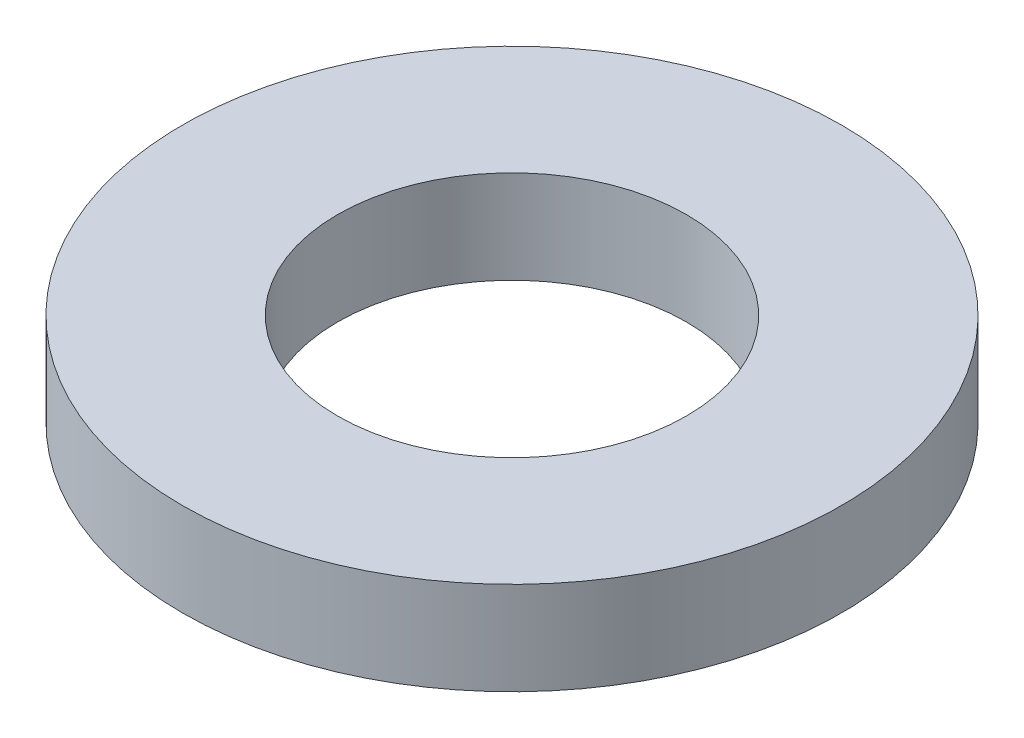
ISO-10303-21;
HEADER;
FILE_DESCRIPTION(('STEP AP214'),'2;1');
FILE_NAME('part.step','',(''),(''),'','','');
FILE_SCHEMA(('AUTOMOTIVE_DESIGN { 1 0 10303 214 1 1 1 1 }'));
ENDSEC;
DATA;
#1=APPLICATION_CONTEXT('core data for automotive mechanical design processes');
#2=APPLICATION_PROTOCOL_DEFINITION('international standard','automotive_design',2000,#1);
#3=PRODUCT_CONTEXT('',#1,'mechanical');
#4=PRODUCT('Part','Part','',(#3));
#5=PRODUCT_RELATED_PRODUCT_CATEGORY('part','',(#4));
#6=PRODUCT_DEFINITION_FORMATION('','',#4);
#7=PRODUCT_DEFINITION_CONTEXT('part definition',#1,'design');
#8=PRODUCT_DEFINITION('design','',#6,#7);
#9=PRODUCT_DEFINITION_SHAPE('','',#8);
#10=(LENGTH_UNIT() NAMED_UNIT(*) SI_UNIT(.MILLI.,.METRE.));
#11=(NAMED_UNIT(*) PLANE_ANGLE_UNIT() SI_UNIT($,.RADIAN.));
#12=(NAMED_UNIT(*) SI_UNIT($,.STERADIAN.) SOLID_ANGLE_UNIT());
#13=UNCERTAINTY_MEASURE_WITH_UNIT(LENGTH_MEASURE(1.E-05),#10,'distance_accuracy_value','');
#14=(GEOMETRIC_REPRESENTATION_CONTEXT(3) GLOBAL_UNCERTAINTY_ASSIGNED_CONTEXT((#13)) GLOBAL_UNIT_ASSIGNED_CONTEXT((#10,
#11,#12)) REPRESENTATION_CONTEXT('',''));
#15=CARTESIAN_POINT('',(0.,0.,0.));
#16=DIRECTION('',(0.,0.,1.));
#17=DIRECTION('',(1.,0.,0.));
#18=AXIS2_PLACEMENT_3D('',#15,#16,#17);
#19=CARTESIAN_POINT('',(0.,24.,0.));
#20=DIRECTION('',(0.,-1.,0.));
#21=DIRECTION('',(0.,0.,-1.));
#22=AXIS2_PLACEMENT_3D('',#19,#20,#21);
#23=CYLINDRICAL_SURFACE('',#22,85.);
#24=CARTESIAN_POINT('',(0.,24.,0.));
#25=DIRECTION('',(0.,1.,0.));
#26=DIRECTION('',(0.,0.,1.));
#27=AXIS2_PLACEMENT_3D('',#24,#25,#26);
#28=CIRCLE('',#27,85.);
#29=CARTESIAN_POINT('',(0.,24.,85.));
#30=VERTEX_POINT('',#29);
#31=EDGE_CURVE('E10',#30,#30,#28,.T.);
#32=ORIENTED_EDGE('',*,*,#31,.F.);
#33=EDGE_LOOP('',(#32));
#34=FACE_BOUND('',#33,.T.);
#35=CARTESIAN_POINT('',(0.,0.,0.));
#36=DIRECTION('',(0.,1.,0.));
#37=DIRECTION('',(0.,0.,1.));
#38=AXIS2_PLACEMENT_3D('',#35,#36,#37);
#39=CIRCLE('',#38,85.);
#40=CARTESIAN_POINT('',(0.,0.,85.));
#41=VERTEX_POINT('',#40);
#42=EDGE_CURVE('E37',#41,#41,#39,.T.);
#43=ORIENTED_EDGE('',*,*,#42,.T.);
#44=EDGE_LOOP('',(#43));
#45=FACE_BOUND('',#44,.T.);
#46=ADVANCED_FACE('F40',(#34,#45),#23,.T.);
#47=CARTESIAN_POINT('',(0.,24.,0.));
#48=DIRECTION('',(0.,1.,0.));
#49=DIRECTION('',(0.,0.,1.));
#50=AXIS2_PLACEMENT_3D('',#47,#48,#49);
#51=PLANE('',#50);
#52=CARTESIAN_POINT('',(0.,24.,0.));
#53=DIRECTION('',(0.,1.,0.));
#54=DIRECTION('',(0.,0.,1.));
#55=AXIS2_PLACEMENT_3D('',#52,#53,#54);
#56=CIRCLE('',#55,45.);
#57=CARTESIAN_POINT('',(0.,24.,45.));
#58=VERTEX_POINT('',#57);
#59=EDGE_CURVE('E50',#58,#58,#56,.T.);
#60=ORIENTED_EDGE('',*,*,#59,.F.);
#61=EDGE_LOOP('',(#60));
#62=FACE_BOUND('',#61,.T.);
#63=ORIENTED_EDGE('',*,*,#31,.T.);
#64=EDGE_LOOP('',(#63));
#65=FACE_BOUND('',#64,.T.);
#66=ADVANCED_FACE('F59',(#62,#65),#51,.T.);
#67=CARTESIAN_POINT('',(0.,0.,0.));
#68=DIRECTION('',(0.,1.,0.));
#69=DIRECTION('',(0.,0.,1.));
#70=AXIS2_PLACEMENT_3D('',#67,#68,#69);
#71=PLANE('',#70);
#72=CARTESIAN_POINT('',(0.,0.,0.));
#73=DIRECTION('',(0.,1.,0.));
#74=DIRECTION('',(0.,0.,1.));
#75=AXIS2_PLACEMENT_3D('',#72,#73,#74);
#76=CIRCLE('',#75,45.);
#77=CARTESIAN_POINT('',(0.,0.,45.));
#78=VERTEX_POINT('',#77);
#79=EDGE_CURVE('E47',#78,#78,#76,.T.);
#80=ORIENTED_EDGE('',*,*,#79,.T.);
#81=EDGE_LOOP('',(#80));
#82=FACE_BOUND('',#81,.T.);
#83=ORIENTED_EDGE('',*,*,#42,.F.);
#84=EDGE_LOOP('',(#83));
#85=FACE_BOUND('',#84,.T.);
#86=ADVANCED_FACE('F58',(#82,#85),#71,.F.);
#87=CARTESIAN_POINT('',(0.,24.,0.));
#88=DIRECTION('',(0.,-1.,0.));
#89=DIRECTION('',(0.,0.,-1.));
#90=AXIS2_PLACEMENT_3D('',#87,#88,#89);
#91=CYLINDRICAL_SURFACE('',#90,45.);
#92=ORIENTED_EDGE('',*,*,#59,.T.);
#93=EDGE_LOOP('',(#92));
#94=FACE_BOUND('',#93,.T.);
#95=ORIENTED_EDGE('',*,*,#79,.F.);
#96=EDGE_LOOP('',(#95));
#97=FACE_BOUND('',#96,.T.);
#98=ADVANCED_FACE('F54',(#94,#97),#91,.F.);
#99=CLOSED_SHELL('',(#46,#66,#86,#98));
#100=MANIFOLD_SOLID_BREP('B2',#99);
#101=ADVANCED_BREP_SHAPE_REPRESENTATION('',(#18,#100),#14);
#102=SHAPE_DEFINITION_REPRESENTATION(#9,#101);
ENDSEC;
END-ISO-10303-21;
